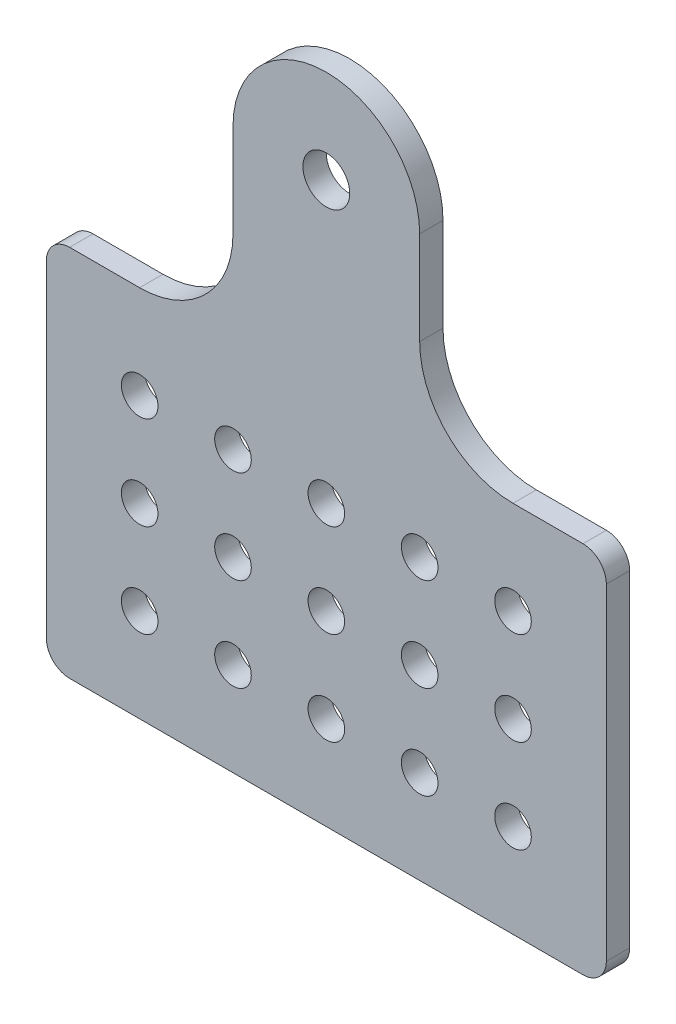
ISO-10303-21;
HEADER;
FILE_DESCRIPTION(('STEP AP214'),'2;1');
FILE_NAME('part.step','',(''),(''),'','','');
FILE_SCHEMA(('AUTOMOTIVE_DESIGN { 1 0 10303 214 1 1 1 1 }'));
ENDSEC;
DATA;
#1=APPLICATION_CONTEXT('core data for automotive mechanical design processes');
#2=APPLICATION_PROTOCOL_DEFINITION('international standard','automotive_design',2000,#1);
#3=PRODUCT_CONTEXT('',#1,'mechanical');
#4=PRODUCT('Part','Part','',(#3));
#5=PRODUCT_RELATED_PRODUCT_CATEGORY('part','',(#4));
#6=PRODUCT_DEFINITION_FORMATION('','',#4);
#7=PRODUCT_DEFINITION_CONTEXT('part definition',#1,'design');
#8=PRODUCT_DEFINITION('design','',#6,#7);
#9=PRODUCT_DEFINITION_SHAPE('','',#8);
#10=(LENGTH_UNIT() NAMED_UNIT(*) SI_UNIT(.MILLI.,.METRE.));
#11=(NAMED_UNIT(*) PLANE_ANGLE_UNIT() SI_UNIT($,.RADIAN.));
#12=(NAMED_UNIT(*) SI_UNIT($,.STERADIAN.) SOLID_ANGLE_UNIT());
#13=UNCERTAINTY_MEASURE_WITH_UNIT(LENGTH_MEASURE(1.E-05),#10,'distance_accuracy_value','');
#14=(GEOMETRIC_REPRESENTATION_CONTEXT(3) GLOBAL_UNCERTAINTY_ASSIGNED_CONTEXT((#13)) GLOBAL_UNIT_ASSIGNED_CONTEXT((#10,
#11,#12)) REPRESENTATION_CONTEXT('',''));
#15=CARTESIAN_POINT('',(0.,0.,0.));
#16=DIRECTION('',(0.,0.,1.));
#17=DIRECTION('',(1.,0.,0.));
#18=AXIS2_PLACEMENT_3D('',#15,#16,#17);
#19=CARTESIAN_POINT('',(0.,38.5884615384616,3.175));
#20=DIRECTION('',(0.,0.,1.));
#21=DIRECTION('',(1.,0.,0.));
#22=AXIS2_PLACEMENT_3D('',#19,#20,#21);
#23=PLANE('',#22);
#24=CARTESIAN_POINT('',(0.,76.2,3.175));
#25=DIRECTION('',(0.,0.,1.));
#26=DIRECTION('',(1.,0.,0.));
#27=AXIS2_PLACEMENT_3D('',#24,#25,#26);
#28=CIRCLE('',#27,3.1877);
#29=CARTESIAN_POINT('',(3.18769999999999,76.2,3.175));
#30=VERTEX_POINT('',#29);
#31=EDGE_CURVE('E231',#30,#30,#28,.F.);
#32=ORIENTED_EDGE('',*,*,#31,.T.);
#33=EDGE_LOOP('',(#32));
#34=FACE_BOUND('',#33,.T.);
#35=CARTESIAN_POINT('',(-25.4,38.1,3.175));
#36=DIRECTION('',(0.,0.,1.));
#37=DIRECTION('',(1.,0.,0.));
#38=AXIS2_PLACEMENT_3D('',#35,#36,#37);
#39=CIRCLE('',#38,2.4892);
#40=CARTESIAN_POINT('',(-22.9108,38.1,3.175));
#41=VERTEX_POINT('',#40);
#42=EDGE_CURVE('E234',#41,#41,#39,.F.);
#43=ORIENTED_EDGE('',*,*,#42,.T.);
#44=EDGE_LOOP('',(#43));
#45=FACE_BOUND('',#44,.T.);
#46=CARTESIAN_POINT('',(-12.7,38.1,3.175));
#47=DIRECTION('',(0.,0.,1.));
#48=DIRECTION('',(1.,0.,0.));
#49=AXIS2_PLACEMENT_3D('',#46,#47,#48);
#50=CIRCLE('',#49,2.4892);
#51=CARTESIAN_POINT('',(-10.2108,38.1,3.175));
#52=VERTEX_POINT('',#51);
#53=EDGE_CURVE('E237',#52,#52,#50,.F.);
#54=ORIENTED_EDGE('',*,*,#53,.T.);
#55=EDGE_LOOP('',(#54));
#56=FACE_BOUND('',#55,.T.);
#57=CARTESIAN_POINT('',(0.,38.1,3.175));
#58=DIRECTION('',(0.,0.,1.));
#59=DIRECTION('',(1.,0.,0.));
#60=AXIS2_PLACEMENT_3D('',#57,#58,#59);
#61=CIRCLE('',#60,2.4892);
#62=CARTESIAN_POINT('',(2.4892,38.1,3.175));
#63=VERTEX_POINT('',#62);
#64=EDGE_CURVE('E240',#63,#63,#61,.F.);
#65=ORIENTED_EDGE('',*,*,#64,.T.);
#66=EDGE_LOOP('',(#65));
#67=FACE_BOUND('',#66,.T.);
#68=CARTESIAN_POINT('',(12.7,38.1,3.175));
#69=DIRECTION('',(0.,0.,1.));
#70=DIRECTION('',(1.,0.,0.));
#71=AXIS2_PLACEMENT_3D('',#68,#69,#70);
#72=CIRCLE('',#71,2.4892);
#73=CARTESIAN_POINT('',(15.1892,38.1,3.175));
#74=VERTEX_POINT('',#73);
#75=EDGE_CURVE('E243',#74,#74,#72,.F.);
#76=ORIENTED_EDGE('',*,*,#75,.T.);
#77=EDGE_LOOP('',(#76));
#78=FACE_BOUND('',#77,.T.);
#79=CARTESIAN_POINT('',(25.4,38.1,3.175));
#80=DIRECTION('',(0.,0.,1.));
#81=DIRECTION('',(1.,0.,0.));
#82=AXIS2_PLACEMENT_3D('',#79,#80,#81);
#83=CIRCLE('',#82,2.4892);
#84=CARTESIAN_POINT('',(27.8892,38.1,3.175));
#85=VERTEX_POINT('',#84);
#86=EDGE_CURVE('E246',#85,#85,#83,.F.);
#87=ORIENTED_EDGE('',*,*,#86,.T.);
#88=EDGE_LOOP('',(#87));
#89=FACE_BOUND('',#88,.T.);
#90=CARTESIAN_POINT('',(-25.4,25.4,3.175));
#91=DIRECTION('',(0.,0.,1.));
#92=DIRECTION('',(1.,0.,0.));
#93=AXIS2_PLACEMENT_3D('',#90,#91,#92);
#94=CIRCLE('',#93,2.4892);
#95=CARTESIAN_POINT('',(-22.9108,25.4,3.175));
#96=VERTEX_POINT('',#95);
#97=EDGE_CURVE('E249',#96,#96,#94,.F.);
#98=ORIENTED_EDGE('',*,*,#97,.T.);
#99=EDGE_LOOP('',(#98));
#100=FACE_BOUND('',#99,.T.);
#101=CARTESIAN_POINT('',(-12.7,25.4,3.175));
#102=DIRECTION('',(0.,0.,1.));
#103=DIRECTION('',(1.,0.,0.));
#104=AXIS2_PLACEMENT_3D('',#101,#102,#103);
#105=CIRCLE('',#104,2.4892);
#106=CARTESIAN_POINT('',(-10.2108,25.4,3.175));
#107=VERTEX_POINT('',#106);
#108=EDGE_CURVE('E252',#107,#107,#105,.F.);
#109=ORIENTED_EDGE('',*,*,#108,.T.);
#110=EDGE_LOOP('',(#109));
#111=FACE_BOUND('',#110,.T.);
#112=CARTESIAN_POINT('',(0.,25.4,3.175));
#113=DIRECTION('',(0.,0.,1.));
#114=DIRECTION('',(1.,0.,0.));
#115=AXIS2_PLACEMENT_3D('',#112,#113,#114);
#116=CIRCLE('',#115,2.4892);
#117=CARTESIAN_POINT('',(2.4892,25.4,3.175));
#118=VERTEX_POINT('',#117);
#119=EDGE_CURVE('E255',#118,#118,#116,.F.);
#120=ORIENTED_EDGE('',*,*,#119,.T.);
#121=EDGE_LOOP('',(#120));
#122=FACE_BOUND('',#121,.T.);
#123=CARTESIAN_POINT('',(12.7,25.4,3.175));
#124=DIRECTION('',(0.,0.,1.));
#125=DIRECTION('',(1.,0.,0.));
#126=AXIS2_PLACEMENT_3D('',#123,#124,#125);
#127=CIRCLE('',#126,2.4892);
#128=CARTESIAN_POINT('',(15.1892,25.4,3.175));
#129=VERTEX_POINT('',#128);
#130=EDGE_CURVE('E258',#129,#129,#127,.F.);
#131=ORIENTED_EDGE('',*,*,#130,.T.);
#132=EDGE_LOOP('',(#131));
#133=FACE_BOUND('',#132,.T.);
#134=CARTESIAN_POINT('',(25.4,25.4,3.175));
#135=DIRECTION('',(0.,0.,1.));
#136=DIRECTION('',(1.,0.,0.));
#137=AXIS2_PLACEMENT_3D('',#134,#135,#136);
#138=CIRCLE('',#137,2.4892);
#139=CARTESIAN_POINT('',(27.8892,25.4,3.175));
#140=VERTEX_POINT('',#139);
#141=EDGE_CURVE('E261',#140,#140,#138,.F.);
#142=ORIENTED_EDGE('',*,*,#141,.T.);
#143=EDGE_LOOP('',(#142));
#144=FACE_BOUND('',#143,.T.);
#145=CARTESIAN_POINT('',(-25.4,12.7,3.175));
#146=DIRECTION('',(0.,0.,1.));
#147=DIRECTION('',(1.,0.,0.));
#148=AXIS2_PLACEMENT_3D('',#145,#146,#147);
#149=CIRCLE('',#148,2.4892);
#150=CARTESIAN_POINT('',(-22.9108,12.7,3.175));
#151=VERTEX_POINT('',#150);
#152=EDGE_CURVE('E264',#151,#151,#149,.F.);
#153=ORIENTED_EDGE('',*,*,#152,.T.);
#154=EDGE_LOOP('',(#153));
#155=FACE_BOUND('',#154,.T.);
#156=CARTESIAN_POINT('',(-12.7,12.7,3.175));
#157=DIRECTION('',(0.,0.,1.));
#158=DIRECTION('',(1.,0.,0.));
#159=AXIS2_PLACEMENT_3D('',#156,#157,#158);
#160=CIRCLE('',#159,2.4892);
#161=CARTESIAN_POINT('',(-10.2108,12.7,3.175));
#162=VERTEX_POINT('',#161);
#163=EDGE_CURVE('E267',#162,#162,#160,.F.);
#164=ORIENTED_EDGE('',*,*,#163,.T.);
#165=EDGE_LOOP('',(#164));
#166=FACE_BOUND('',#165,.T.);
#167=CARTESIAN_POINT('',(0.,12.7,3.175));
#168=DIRECTION('',(0.,0.,1.));
#169=DIRECTION('',(1.,0.,0.));
#170=AXIS2_PLACEMENT_3D('',#167,#168,#169);
#171=CIRCLE('',#170,2.4892);
#172=CARTESIAN_POINT('',(2.4892,12.7,3.175));
#173=VERTEX_POINT('',#172);
#174=EDGE_CURVE('E270',#173,#173,#171,.F.);
#175=ORIENTED_EDGE('',*,*,#174,.T.);
#176=EDGE_LOOP('',(#175));
#177=FACE_BOUND('',#176,.T.);
#178=CARTESIAN_POINT('',(12.7,12.7,3.175));
#179=DIRECTION('',(0.,0.,1.));
#180=DIRECTION('',(1.,0.,0.));
#181=AXIS2_PLACEMENT_3D('',#178,#179,#180);
#182=CIRCLE('',#181,2.4892);
#183=CARTESIAN_POINT('',(15.1892,12.7,3.175));
#184=VERTEX_POINT('',#183);
#185=EDGE_CURVE('E273',#184,#184,#182,.F.);
#186=ORIENTED_EDGE('',*,*,#185,.T.);
#187=EDGE_LOOP('',(#186));
#188=FACE_BOUND('',#187,.T.);
#189=CARTESIAN_POINT('',(25.4,12.7,3.175));
#190=DIRECTION('',(0.,0.,1.));
#191=DIRECTION('',(1.,0.,0.));
#192=AXIS2_PLACEMENT_3D('',#189,#190,#191);
#193=CIRCLE('',#192,2.4892);
#194=CARTESIAN_POINT('',(27.8892,12.7,3.175));
#195=VERTEX_POINT('',#194);
#196=EDGE_CURVE('E276',#195,#195,#193,.F.);
#197=ORIENTED_EDGE('',*,*,#196,.T.);
#198=EDGE_LOOP('',(#197));
#199=FACE_BOUND('',#198,.T.);
#200=CARTESIAN_POINT('',(25.4,63.5,3.175));
#201=DIRECTION('',(0.,0.,1.));
#202=DIRECTION('',(1.,0.,0.));
#203=AXIS2_PLACEMENT_3D('',#200,#201,#202);
#204=CIRCLE('',#203,12.7);
#205=CARTESIAN_POINT('',(25.4,50.8,3.175));
#206=VERTEX_POINT('',#205);
#207=CARTESIAN_POINT('',(12.7,63.5,3.175));
#208=VERTEX_POINT('',#207);
#209=EDGE_CURVE('E281',#206,#208,#204,.F.);
#210=ORIENTED_EDGE('',*,*,#209,.T.);
#211=DIRECTION('',(0.,1.,0.));
#212=VECTOR('',#211,1.);
#213=CARTESIAN_POINT('',(12.7,50.8,3.175));
#214=LINE('',#213,#212);
#215=CARTESIAN_POINT('',(12.7,76.2,3.175));
#216=VERTEX_POINT('',#215);
#217=EDGE_CURVE('E142',#216,#208,#214,.F.);
#218=ORIENTED_EDGE('',*,*,#217,.F.);
#219=CARTESIAN_POINT('',(0.,76.2,3.175));
#220=DIRECTION('',(0.,0.,1.));
#221=DIRECTION('',(1.,0.,0.));
#222=AXIS2_PLACEMENT_3D('',#219,#220,#221);
#223=CIRCLE('',#222,12.7);
#224=CARTESIAN_POINT('',(-12.7,76.2,3.175));
#225=VERTEX_POINT('',#224);
#226=EDGE_CURVE('E145',#225,#216,#223,.F.);
#227=ORIENTED_EDGE('',*,*,#226,.F.);
#228=DIRECTION('',(0.,-1.,0.));
#229=VECTOR('',#228,1.);
#230=CARTESIAN_POINT('',(-12.7,88.9,3.175));
#231=LINE('',#230,#229);
#232=CARTESIAN_POINT('',(-12.7,63.5,3.175));
#233=VERTEX_POINT('',#232);
#234=EDGE_CURVE('E113',#233,#225,#231,.F.);
#235=ORIENTED_EDGE('',*,*,#234,.F.);
#236=CARTESIAN_POINT('',(-25.4,63.5,3.175));
#237=DIRECTION('',(0.,0.,1.));
#238=DIRECTION('',(1.,0.,0.));
#239=AXIS2_PLACEMENT_3D('',#236,#237,#238);
#240=CIRCLE('',#239,12.7);
#241=CARTESIAN_POINT('',(-25.4,50.8,3.175));
#242=VERTEX_POINT('',#241);
#243=EDGE_CURVE('E18',#233,#242,#240,.F.);
#244=ORIENTED_EDGE('',*,*,#243,.T.);
#245=DIRECTION('',(-1.,0.,0.));
#246=VECTOR('',#245,1.);
#247=CARTESIAN_POINT('',(-12.7,50.8,3.175));
#248=LINE('',#247,#246);
#249=CARTESIAN_POINT('',(-34.925,50.8,3.175));
#250=VERTEX_POINT('',#249);
#251=EDGE_CURVE('E118',#250,#242,#248,.F.);
#252=ORIENTED_EDGE('',*,*,#251,.F.);
#253=CARTESIAN_POINT('',(-34.925,47.625,3.175));
#254=DIRECTION('',(0.,0.,1.));
#255=DIRECTION('',(1.,0.,0.));
#256=AXIS2_PLACEMENT_3D('',#253,#254,#255);
#257=CIRCLE('',#256,3.175);
#258=CARTESIAN_POINT('',(-38.1,47.625,3.175));
#259=VERTEX_POINT('',#258);
#260=EDGE_CURVE('E130',#259,#250,#257,.F.);
#261=ORIENTED_EDGE('',*,*,#260,.F.);
#262=DIRECTION('',(0.,1.,0.));
#263=VECTOR('',#262,1.);
#264=CARTESIAN_POINT('',(-38.1,50.8,3.175));
#265=LINE('',#264,#263);
#266=CARTESIAN_POINT('',(-38.1,3.175,3.175));
#267=VERTEX_POINT('',#266);
#268=EDGE_CURVE('E159',#267,#259,#265,.T.);
#269=ORIENTED_EDGE('',*,*,#268,.F.);
#270=CARTESIAN_POINT('',(-34.925,3.175,3.175));
#271=DIRECTION('',(0.,0.,1.));
#272=DIRECTION('',(1.,0.,0.));
#273=AXIS2_PLACEMENT_3D('',#270,#271,#272);
#274=CIRCLE('',#273,3.175);
#275=CARTESIAN_POINT('',(-34.925,0.,3.175));
#276=VERTEX_POINT('',#275);
#277=EDGE_CURVE('E288',#276,#267,#274,.F.);
#278=ORIENTED_EDGE('',*,*,#277,.F.);
#279=DIRECTION('',(1.,0.,0.));
#280=VECTOR('',#279,1.);
#281=CARTESIAN_POINT('',(-38.1,0.,3.175));
#282=LINE('',#281,#280);
#283=CARTESIAN_POINT('',(34.925,0.,3.175));
#284=VERTEX_POINT('',#283);
#285=EDGE_CURVE('E155',#284,#276,#282,.F.);
#286=ORIENTED_EDGE('',*,*,#285,.F.);
#287=CARTESIAN_POINT('',(34.925,3.17500000000003,3.175));
#288=DIRECTION('',(0.,0.,1.));
#289=DIRECTION('',(1.,0.,0.));
#290=AXIS2_PLACEMENT_3D('',#287,#288,#289);
#291=CIRCLE('',#290,3.175);
#292=CARTESIAN_POINT('',(38.1,3.17500000000003,3.175));
#293=VERTEX_POINT('',#292);
#294=EDGE_CURVE('E286',#293,#284,#291,.F.);
#295=ORIENTED_EDGE('',*,*,#294,.F.);
#296=DIRECTION('',(0.,1.,0.));
#297=VECTOR('',#296,1.);
#298=CARTESIAN_POINT('',(38.1,0.,3.175));
#299=LINE('',#298,#297);
#300=CARTESIAN_POINT('',(38.1,47.625,3.175));
#301=VERTEX_POINT('',#300);
#302=EDGE_CURVE('E151',#301,#293,#299,.F.);
#303=ORIENTED_EDGE('',*,*,#302,.F.);
#304=CARTESIAN_POINT('',(34.925,47.625,3.175));
#305=DIRECTION('',(0.,0.,1.));
#306=DIRECTION('',(1.,0.,0.));
#307=AXIS2_PLACEMENT_3D('',#304,#305,#306);
#308=CIRCLE('',#307,3.175);
#309=CARTESIAN_POINT('',(34.925,50.8,3.175));
#310=VERTEX_POINT('',#309);
#311=EDGE_CURVE('E284',#310,#301,#308,.F.);
#312=ORIENTED_EDGE('',*,*,#311,.F.);
#313=DIRECTION('',(-1.,0.,0.));
#314=VECTOR('',#313,1.);
#315=CARTESIAN_POINT('',(38.1,50.8,3.175));
#316=LINE('',#315,#314);
#317=EDGE_CURVE('E147',#206,#310,#316,.F.);
#318=ORIENTED_EDGE('',*,*,#317,.F.);
#319=EDGE_LOOP('',(#210,#218,#227,#235,#244,#252,#261,#269,#278,#286,#295,#303,#312,#318));
#320=FACE_BOUND('',#319,.T.);
#321=ADVANCED_FACE('F15',(#34,#45,#56,#67,#78,#89,#100,#111,#122,#133,#144,#155,#166,#177,#188,
#199,#320),#23,.T.);
#322=CARTESIAN_POINT('',(-12.7,88.9,0.));
#323=DIRECTION('',(-1.,0.,0.));
#324=DIRECTION('',(0.,-1.,0.));
#325=AXIS2_PLACEMENT_3D('',#322,#323,#324);
#326=PLANE('',#325);
#327=DIRECTION('',(0.,0.,1.));
#328=VECTOR('',#327,1.);
#329=CARTESIAN_POINT('',(-12.7,76.2,0.));
#330=LINE('',#329,#328);
#331=CARTESIAN_POINT('',(-12.7,76.2,0.));
#332=VERTEX_POINT('',#331);
#333=EDGE_CURVE('E279',#332,#225,#330,.T.);
#334=ORIENTED_EDGE('',*,*,#333,.F.);
#335=DIRECTION('',(0.,1.,0.));
#336=VECTOR('',#335,1.);
#337=CARTESIAN_POINT('',(-12.7,38.5884615384616,0.));
#338=LINE('',#337,#336);
#339=CARTESIAN_POINT('',(-12.7,63.5,0.));
#340=VERTEX_POINT('',#339);
#341=EDGE_CURVE('E230',#332,#340,#338,.F.);
#342=ORIENTED_EDGE('',*,*,#341,.T.);
#343=DIRECTION('',(0.,0.,1.));
#344=VECTOR('',#343,1.);
#345=CARTESIAN_POINT('',(-12.7,63.5,0.));
#346=LINE('',#345,#344);
#347=EDGE_CURVE('E124',#340,#233,#346,.T.);
#348=ORIENTED_EDGE('',*,*,#347,.T.);
#349=ORIENTED_EDGE('',*,*,#234,.T.);
#350=EDGE_LOOP('',(#334,#342,#348,#349));
#351=FACE_BOUND('',#350,.T.);
#352=ADVANCED_FACE('F365',(#351),#326,.T.);
#353=CARTESIAN_POINT('',(-25.4,63.5,0.));
#354=DIRECTION('',(0.,0.,1.));
#355=DIRECTION('',(1.,0.,0.));
#356=AXIS2_PLACEMENT_3D('',#353,#354,#355);
#357=CYLINDRICAL_SURFACE('',#356,12.7);
#358=DIRECTION('',(0.,0.,1.));
#359=VECTOR('',#358,1.);
#360=CARTESIAN_POINT('',(-25.4,50.8,0.));
#361=LINE('',#360,#359);
#362=CARTESIAN_POINT('',(-25.4,50.8,0.));
#363=VERTEX_POINT('',#362);
#364=EDGE_CURVE('E123',#242,#363,#361,.F.);
#365=ORIENTED_EDGE('',*,*,#364,.F.);
#366=ORIENTED_EDGE('',*,*,#243,.F.);
#367=ORIENTED_EDGE('',*,*,#347,.F.);
#368=CARTESIAN_POINT('',(-25.4,63.5,0.));
#369=DIRECTION('',(0.,0.,1.));
#370=DIRECTION('',(1.,0.,0.));
#371=AXIS2_PLACEMENT_3D('',#368,#369,#370);
#372=CIRCLE('',#371,12.7);
#373=EDGE_CURVE('E135',#340,#363,#372,.F.);
#374=ORIENTED_EDGE('',*,*,#373,.T.);
#375=EDGE_LOOP('',(#365,#366,#367,#374));
#376=FACE_BOUND('',#375,.T.);
#377=ADVANCED_FACE('F133',(#376),#357,.F.);
#378=CARTESIAN_POINT('',(-12.7,50.8,0.));
#379=DIRECTION('',(0.,1.,0.));
#380=DIRECTION('',(-1.,0.,0.));
#381=AXIS2_PLACEMENT_3D('',#378,#379,#380);
#382=PLANE('',#381);
#383=DIRECTION('',(0.,0.,1.));
#384=VECTOR('',#383,1.);
#385=CARTESIAN_POINT('',(-34.925,50.8,0.));
#386=LINE('',#385,#384);
#387=CARTESIAN_POINT('',(-34.925,50.8,0.));
#388=VERTEX_POINT('',#387);
#389=EDGE_CURVE('E129',#250,#388,#386,.F.);
#390=ORIENTED_EDGE('',*,*,#389,.F.);
#391=ORIENTED_EDGE('',*,*,#251,.T.);
#392=ORIENTED_EDGE('',*,*,#364,.T.);
#393=DIRECTION('',(1.,0.,0.));
#394=VECTOR('',#393,1.);
#395=CARTESIAN_POINT('',(0.,50.8,0.));
#396=LINE('',#395,#394);
#397=EDGE_CURVE('E228',#363,#388,#396,.F.);
#398=ORIENTED_EDGE('',*,*,#397,.T.);
#399=EDGE_LOOP('',(#390,#391,#392,#398));
#400=FACE_BOUND('',#399,.T.);
#401=ADVANCED_FACE('F126',(#400),#382,.T.);
#402=CARTESIAN_POINT('',(-34.925,47.625,0.));
#403=DIRECTION('',(0.,0.,1.));
#404=DIRECTION('',(1.,0.,0.));
#405=AXIS2_PLACEMENT_3D('',#402,#403,#404);
#406=CYLINDRICAL_SURFACE('',#405,3.175);
#407=CARTESIAN_POINT('',(-34.925,47.625,0.));
#408=DIRECTION('',(0.,0.,1.));
#409=DIRECTION('',(1.,0.,0.));
#410=AXIS2_PLACEMENT_3D('',#407,#408,#409);
#411=CIRCLE('',#410,3.175);
#412=CARTESIAN_POINT('',(-38.1,47.625,0.));
#413=VERTEX_POINT('',#412);
#414=EDGE_CURVE('E225',#388,#413,#411,.T.);
#415=ORIENTED_EDGE('',*,*,#414,.T.);
#416=DIRECTION('',(0.,0.,1.));
#417=VECTOR('',#416,1.);
#418=CARTESIAN_POINT('',(-38.1,47.625,0.));
#419=LINE('',#418,#417);
#420=EDGE_CURVE('E160',#259,#413,#419,.F.);
#421=ORIENTED_EDGE('',*,*,#420,.F.);
#422=ORIENTED_EDGE('',*,*,#260,.T.);
#423=ORIENTED_EDGE('',*,*,#389,.T.);
#424=EDGE_LOOP('',(#415,#421,#422,#423));
#425=FACE_BOUND('',#424,.T.);
#426=ADVANCED_FACE('F292',(#425),#406,.T.);
#427=CARTESIAN_POINT('',(-38.1,50.8,0.));
#428=DIRECTION('',(-1.,0.,0.));
#429=DIRECTION('',(0.,0.,1.));
#430=AXIS2_PLACEMENT_3D('',#427,#428,#429);
#431=PLANE('',#430);
#432=ORIENTED_EDGE('',*,*,#420,.T.);
#433=DIRECTION('',(0.,1.,0.));
#434=VECTOR('',#433,1.);
#435=CARTESIAN_POINT('',(-38.1,38.5884615384616,0.));
#436=LINE('',#435,#434);
#437=CARTESIAN_POINT('',(-38.1,3.175,0.));
#438=VERTEX_POINT('',#437);
#439=EDGE_CURVE('E224',#413,#438,#436,.F.);
#440=ORIENTED_EDGE('',*,*,#439,.T.);
#441=DIRECTION('',(0.,0.,1.));
#442=VECTOR('',#441,1.);
#443=CARTESIAN_POINT('',(-38.1,3.175,0.));
#444=LINE('',#443,#442);
#445=EDGE_CURVE('E158',#267,#438,#444,.F.);
#446=ORIENTED_EDGE('',*,*,#445,.F.);
#447=ORIENTED_EDGE('',*,*,#268,.T.);
#448=EDGE_LOOP('',(#432,#440,#446,#447));
#449=FACE_BOUND('',#448,.T.);
#450=ADVANCED_FACE('F317',(#449),#431,.T.);
#451=CARTESIAN_POINT('',(-34.925,3.175,0.));
#452=DIRECTION('',(0.,0.,1.));
#453=DIRECTION('',(1.,0.,0.));
#454=AXIS2_PLACEMENT_3D('',#451,#452,#453);
#455=CYLINDRICAL_SURFACE('',#454,3.175);
#456=CARTESIAN_POINT('',(-34.925,3.175,0.));
#457=DIRECTION('',(0.,0.,1.));
#458=DIRECTION('',(1.,0.,0.));
#459=AXIS2_PLACEMENT_3D('',#456,#457,#458);
#460=CIRCLE('',#459,3.175);
#461=CARTESIAN_POINT('',(-34.925,0.,0.));
#462=VERTEX_POINT('',#461);
#463=EDGE_CURVE('E221',#438,#462,#460,.T.);
#464=ORIENTED_EDGE('',*,*,#463,.T.);
#465=DIRECTION('',(0.,0.,1.));
#466=VECTOR('',#465,1.);
#467=CARTESIAN_POINT('',(-34.925,0.,0.));
#468=LINE('',#467,#466);
#469=EDGE_CURVE('E157',#276,#462,#468,.F.);
#470=ORIENTED_EDGE('',*,*,#469,.F.);
#471=ORIENTED_EDGE('',*,*,#277,.T.);
#472=ORIENTED_EDGE('',*,*,#445,.T.);
#473=EDGE_LOOP('',(#464,#470,#471,#472));
#474=FACE_BOUND('',#473,.T.);
#475=ADVANCED_FACE('F326',(#474),#455,.T.);
#476=CARTESIAN_POINT('',(-38.1,0.,0.));
#477=DIRECTION('',(0.,-1.,0.));
#478=DIRECTION('',(1.,0.,0.));
#479=AXIS2_PLACEMENT_3D('',#476,#477,#478);
#480=PLANE('',#479);
#481=ORIENTED_EDGE('',*,*,#469,.T.);
#482=DIRECTION('',(1.,0.,0.));
#483=VECTOR('',#482,1.);
#484=CARTESIAN_POINT('',(0.,0.,0.));
#485=LINE('',#484,#483);
#486=CARTESIAN_POINT('',(34.925,0.,0.));
#487=VERTEX_POINT('',#486);
#488=EDGE_CURVE('E220',#462,#487,#485,.T.);
#489=ORIENTED_EDGE('',*,*,#488,.T.);
#490=DIRECTION('',(0.,0.,1.));
#491=VECTOR('',#490,1.);
#492=CARTESIAN_POINT('',(34.925,0.,0.));
#493=LINE('',#492,#491);
#494=EDGE_CURVE('E154',#284,#487,#493,.F.);
#495=ORIENTED_EDGE('',*,*,#494,.F.);
#496=ORIENTED_EDGE('',*,*,#285,.T.);
#497=EDGE_LOOP('',(#481,#489,#495,#496));
#498=FACE_BOUND('',#497,.T.);
#499=ADVANCED_FACE('F330',(#498),#480,.T.);
#500=CARTESIAN_POINT('',(34.925,3.17500000000003,0.));
#501=DIRECTION('',(0.,0.,1.));
#502=DIRECTION('',(1.,0.,0.));
#503=AXIS2_PLACEMENT_3D('',#500,#501,#502);
#504=CYLINDRICAL_SURFACE('',#503,3.175);
#505=CARTESIAN_POINT('',(34.925,3.17500000000003,0.));
#506=DIRECTION('',(0.,0.,1.));
#507=DIRECTION('',(1.,0.,0.));
#508=AXIS2_PLACEMENT_3D('',#505,#506,#507);
#509=CIRCLE('',#508,3.175);
#510=CARTESIAN_POINT('',(38.1,3.17500000000003,0.));
#511=VERTEX_POINT('',#510);
#512=EDGE_CURVE('E217',#487,#511,#509,.T.);
#513=ORIENTED_EDGE('',*,*,#512,.T.);
#514=DIRECTION('',(0.,0.,1.));
#515=VECTOR('',#514,1.);
#516=CARTESIAN_POINT('',(38.1,3.17500000000003,0.));
#517=LINE('',#516,#515);
#518=EDGE_CURVE('E153',#293,#511,#517,.F.);
#519=ORIENTED_EDGE('',*,*,#518,.F.);
#520=ORIENTED_EDGE('',*,*,#294,.T.);
#521=ORIENTED_EDGE('',*,*,#494,.T.);
#522=EDGE_LOOP('',(#513,#519,#520,#521));
#523=FACE_BOUND('',#522,.T.);
#524=ADVANCED_FACE('F360',(#523),#504,.T.);
#525=CARTESIAN_POINT('',(38.1,0.,0.));
#526=DIRECTION('',(1.,0.,0.));
#527=DIRECTION('',(0.,1.,0.));
#528=AXIS2_PLACEMENT_3D('',#525,#526,#527);
#529=PLANE('',#528);
#530=ORIENTED_EDGE('',*,*,#518,.T.);
#531=DIRECTION('',(0.,1.,0.));
#532=VECTOR('',#531,1.);
#533=CARTESIAN_POINT('',(38.1,38.5884615384616,0.));
#534=LINE('',#533,#532);
#535=CARTESIAN_POINT('',(38.1,47.625,0.));
#536=VERTEX_POINT('',#535);
#537=EDGE_CURVE('E216',#511,#536,#534,.T.);
#538=ORIENTED_EDGE('',*,*,#537,.T.);
#539=DIRECTION('',(0.,0.,1.));
#540=VECTOR('',#539,1.);
#541=CARTESIAN_POINT('',(38.1,47.625,0.));
#542=LINE('',#541,#540);
#543=EDGE_CURVE('E150',#301,#536,#542,.F.);
#544=ORIENTED_EDGE('',*,*,#543,.F.);
#545=ORIENTED_EDGE('',*,*,#302,.T.);
#546=EDGE_LOOP('',(#530,#538,#544,#545));
#547=FACE_BOUND('',#546,.T.);
#548=ADVANCED_FACE('F357',(#547),#529,.T.);
#549=CARTESIAN_POINT('',(34.925,47.625,0.));
#550=DIRECTION('',(0.,0.,1.));
#551=DIRECTION('',(1.,0.,0.));
#552=AXIS2_PLACEMENT_3D('',#549,#550,#551);
#553=CYLINDRICAL_SURFACE('',#552,3.175);
#554=CARTESIAN_POINT('',(34.925,47.625,0.));
#555=DIRECTION('',(0.,0.,1.));
#556=DIRECTION('',(1.,0.,0.));
#557=AXIS2_PLACEMENT_3D('',#554,#555,#556);
#558=CIRCLE('',#557,3.175);
#559=CARTESIAN_POINT('',(34.925,50.8,0.));
#560=VERTEX_POINT('',#559);
#561=EDGE_CURVE('E213',#536,#560,#558,.T.);
#562=ORIENTED_EDGE('',*,*,#561,.T.);
#563=DIRECTION('',(0.,0.,1.));
#564=VECTOR('',#563,1.);
#565=CARTESIAN_POINT('',(34.925,50.8,0.));
#566=LINE('',#565,#564);
#567=EDGE_CURVE('E149',#310,#560,#566,.F.);
#568=ORIENTED_EDGE('',*,*,#567,.F.);
#569=ORIENTED_EDGE('',*,*,#311,.T.);
#570=ORIENTED_EDGE('',*,*,#543,.T.);
#571=EDGE_LOOP('',(#562,#568,#569,#570));
#572=FACE_BOUND('',#571,.T.);
#573=ADVANCED_FACE('F353',(#572),#553,.T.);
#574=CARTESIAN_POINT('',(38.1,50.8,0.));
#575=DIRECTION('',(0.,1.,0.));
#576=DIRECTION('',(-1.,0.,0.));
#577=AXIS2_PLACEMENT_3D('',#574,#575,#576);
#578=PLANE('',#577);
#579=ORIENTED_EDGE('',*,*,#567,.T.);
#580=DIRECTION('',(1.,0.,0.));
#581=VECTOR('',#580,1.);
#582=CARTESIAN_POINT('',(0.,50.8,0.));
#583=LINE('',#582,#581);
#584=CARTESIAN_POINT('',(25.4,50.8,0.));
#585=VERTEX_POINT('',#584);
#586=EDGE_CURVE('E212',#560,#585,#583,.F.);
#587=ORIENTED_EDGE('',*,*,#586,.T.);
#588=DIRECTION('',(0.,0.,1.));
#589=VECTOR('',#588,1.);
#590=CARTESIAN_POINT('',(25.4,50.8,0.));
#591=LINE('',#590,#589);
#592=EDGE_CURVE('E283',#585,#206,#591,.T.);
#593=ORIENTED_EDGE('',*,*,#592,.T.);
#594=ORIENTED_EDGE('',*,*,#317,.T.);
#595=EDGE_LOOP('',(#579,#587,#593,#594));
#596=FACE_BOUND('',#595,.T.);
#597=ADVANCED_FACE('F348',(#596),#578,.T.);
#598=CARTESIAN_POINT('',(25.4,63.5,0.));
#599=DIRECTION('',(0.,0.,1.));
#600=DIRECTION('',(1.,0.,0.));
#601=AXIS2_PLACEMENT_3D('',#598,#599,#600);
#602=CYLINDRICAL_SURFACE('',#601,12.7);
#603=DIRECTION('',(0.,0.,-1.));
#604=VECTOR('',#603,1.);
#605=CARTESIAN_POINT('',(12.7,63.5,0.));
#606=LINE('',#605,#604);
#607=CARTESIAN_POINT('',(12.7,63.5,0.));
#608=VERTEX_POINT('',#607);
#609=EDGE_CURVE('E146',#208,#608,#606,.T.);
#610=ORIENTED_EDGE('',*,*,#609,.F.);
#611=ORIENTED_EDGE('',*,*,#209,.F.);
#612=ORIENTED_EDGE('',*,*,#592,.F.);
#613=CARTESIAN_POINT('',(25.4,63.5,0.));
#614=DIRECTION('',(0.,0.,1.));
#615=DIRECTION('',(1.,0.,0.));
#616=AXIS2_PLACEMENT_3D('',#613,#614,#615);
#617=CIRCLE('',#616,12.7);
#618=EDGE_CURVE('E209',#585,#608,#617,.F.);
#619=ORIENTED_EDGE('',*,*,#618,.T.);
#620=EDGE_LOOP('',(#610,#611,#612,#619));
#621=FACE_BOUND('',#620,.T.);
#622=ADVANCED_FACE('F345',(#621),#602,.F.);
#623=CARTESIAN_POINT('',(12.7,50.8,0.));
#624=DIRECTION('',(1.,0.,0.));
#625=DIRECTION('',(0.,0.,-1.));
#626=AXIS2_PLACEMENT_3D('',#623,#624,#625);
#627=PLANE('',#626);
#628=DIRECTION('',(0.,0.,1.));
#629=VECTOR('',#628,1.);
#630=CARTESIAN_POINT('',(12.7,76.2,0.));
#631=LINE('',#630,#629);
#632=CARTESIAN_POINT('',(12.7,76.2,0.));
#633=VERTEX_POINT('',#632);
#634=EDGE_CURVE('E33',#216,#633,#631,.F.);
#635=ORIENTED_EDGE('',*,*,#634,.F.);
#636=ORIENTED_EDGE('',*,*,#217,.T.);
#637=ORIENTED_EDGE('',*,*,#609,.T.);
#638=DIRECTION('',(0.,1.,0.));
#639=VECTOR('',#638,1.);
#640=CARTESIAN_POINT('',(12.7,38.5884615384616,0.));
#641=LINE('',#640,#639);
#642=EDGE_CURVE('E208',#608,#633,#641,.T.);
#643=ORIENTED_EDGE('',*,*,#642,.T.);
#644=EDGE_LOOP('',(#635,#636,#637,#643));
#645=FACE_BOUND('',#644,.T.);
#646=ADVANCED_FACE('F340',(#645),#627,.T.);
#647=CARTESIAN_POINT('',(0.,76.2,0.));
#648=DIRECTION('',(0.,0.,1.));
#649=DIRECTION('',(1.,0.,0.));
#650=AXIS2_PLACEMENT_3D('',#647,#648,#649);
#651=CYLINDRICAL_SURFACE('',#650,12.7);
#652=CARTESIAN_POINT('',(0.,76.2,0.));
#653=DIRECTION('',(0.,0.,1.));
#654=DIRECTION('',(1.,0.,0.));
#655=AXIS2_PLACEMENT_3D('',#652,#653,#654);
#656=CIRCLE('',#655,12.7);
#657=EDGE_CURVE('E206',#633,#332,#656,.T.);
#658=ORIENTED_EDGE('',*,*,#657,.T.);
#659=ORIENTED_EDGE('',*,*,#333,.T.);
#660=ORIENTED_EDGE('',*,*,#226,.T.);
#661=ORIENTED_EDGE('',*,*,#634,.T.);
#662=EDGE_LOOP('',(#658,#659,#660,#661));
#663=FACE_BOUND('',#662,.T.);
#664=ADVANCED_FACE('F362',(#663),#651,.T.);
#665=CARTESIAN_POINT('',(25.4,12.7,-113.956253835174));
#666=DIRECTION('',(0.,0.,1.));
#667=DIRECTION('',(1.,0.,0.));
#668=AXIS2_PLACEMENT_3D('',#665,#666,#667);
#669=CYLINDRICAL_SURFACE('',#668,2.4892);
#670=ORIENTED_EDGE('',*,*,#196,.F.);
#671=EDGE_LOOP('',(#670));
#672=FACE_BOUND('',#671,.T.);
#673=CARTESIAN_POINT('',(25.4,12.7,0.));
#674=DIRECTION('',(0.,0.,1.));
#675=DIRECTION('',(1.,0.,0.));
#676=AXIS2_PLACEMENT_3D('',#673,#674,#675);
#677=CIRCLE('',#676,2.4892);
#678=CARTESIAN_POINT('',(27.8892,12.7,0.));
#679=VERTEX_POINT('',#678);
#680=EDGE_CURVE('E203',#679,#679,#677,.F.);
#681=ORIENTED_EDGE('',*,*,#680,.T.);
#682=EDGE_LOOP('',(#681));
#683=FACE_BOUND('',#682,.T.);
#684=ADVANCED_FACE('F441',(#672,#683),#669,.F.);
#685=CARTESIAN_POINT('',(12.7,12.7,-113.956253835174));
#686=DIRECTION('',(0.,0.,1.));
#687=DIRECTION('',(1.,0.,0.));
#688=AXIS2_PLACEMENT_3D('',#685,#686,#687);
#689=CYLINDRICAL_SURFACE('',#688,2.4892);
#690=ORIENTED_EDGE('',*,*,#185,.F.);
#691=EDGE_LOOP('',(#690));
#692=FACE_BOUND('',#691,.T.);
#693=CARTESIAN_POINT('',(12.7,12.7,0.));
#694=DIRECTION('',(0.,0.,1.));
#695=DIRECTION('',(1.,0.,0.));
#696=AXIS2_PLACEMENT_3D('',#693,#694,#695);
#697=CIRCLE('',#696,2.4892);
#698=CARTESIAN_POINT('',(15.1892,12.7,0.));
#699=VERTEX_POINT('',#698);
#700=EDGE_CURVE('E200',#699,#699,#697,.F.);
#701=ORIENTED_EDGE('',*,*,#700,.T.);
#702=EDGE_LOOP('',(#701));
#703=FACE_BOUND('',#702,.T.);
#704=ADVANCED_FACE('F437',(#692,#703),#689,.F.);
#705=CARTESIAN_POINT('',(0.,12.7,-113.956253835174));
#706=DIRECTION('',(0.,0.,1.));
#707=DIRECTION('',(1.,0.,0.));
#708=AXIS2_PLACEMENT_3D('',#705,#706,#707);
#709=CYLINDRICAL_SURFACE('',#708,2.4892);
#710=ORIENTED_EDGE('',*,*,#174,.F.);
#711=EDGE_LOOP('',(#710));
#712=FACE_BOUND('',#711,.T.);
#713=CARTESIAN_POINT('',(0.,12.7,0.));
#714=DIRECTION('',(0.,0.,1.));
#715=DIRECTION('',(1.,0.,0.));
#716=AXIS2_PLACEMENT_3D('',#713,#714,#715);
#717=CIRCLE('',#716,2.4892);
#718=CARTESIAN_POINT('',(2.4892,12.7,0.));
#719=VERTEX_POINT('',#718);
#720=EDGE_CURVE('E197',#719,#719,#717,.F.);
#721=ORIENTED_EDGE('',*,*,#720,.T.);
#722=EDGE_LOOP('',(#721));
#723=FACE_BOUND('',#722,.T.);
#724=ADVANCED_FACE('F433',(#712,#723),#709,.F.);
#725=CARTESIAN_POINT('',(-12.7,12.7,-113.956253835174));
#726=DIRECTION('',(0.,0.,1.));
#727=DIRECTION('',(1.,0.,0.));
#728=AXIS2_PLACEMENT_3D('',#725,#726,#727);
#729=CYLINDRICAL_SURFACE('',#728,2.4892);
#730=ORIENTED_EDGE('',*,*,#163,.F.);
#731=EDGE_LOOP('',(#730));
#732=FACE_BOUND('',#731,.T.);
#733=CARTESIAN_POINT('',(-12.7,12.7,0.));
#734=DIRECTION('',(0.,0.,1.));
#735=DIRECTION('',(1.,0.,0.));
#736=AXIS2_PLACEMENT_3D('',#733,#734,#735);
#737=CIRCLE('',#736,2.4892);
#738=CARTESIAN_POINT('',(-10.2108,12.7,0.));
#739=VERTEX_POINT('',#738);
#740=EDGE_CURVE('E194',#739,#739,#737,.F.);
#741=ORIENTED_EDGE('',*,*,#740,.T.);
#742=EDGE_LOOP('',(#741));
#743=FACE_BOUND('',#742,.T.);
#744=ADVANCED_FACE('F429',(#732,#743),#729,.F.);
#745=CARTESIAN_POINT('',(-25.4,12.7,-113.956253835174));
#746=DIRECTION('',(0.,0.,1.));
#747=DIRECTION('',(1.,0.,0.));
#748=AXIS2_PLACEMENT_3D('',#745,#746,#747);
#749=CYLINDRICAL_SURFACE('',#748,2.4892);
#750=ORIENTED_EDGE('',*,*,#152,.F.);
#751=EDGE_LOOP('',(#750));
#752=FACE_BOUND('',#751,.T.);
#753=CARTESIAN_POINT('',(-25.4,12.7,0.));
#754=DIRECTION('',(0.,0.,1.));
#755=DIRECTION('',(1.,0.,0.));
#756=AXIS2_PLACEMENT_3D('',#753,#754,#755);
#757=CIRCLE('',#756,2.4892);
#758=CARTESIAN_POINT('',(-22.9108,12.7,0.));
#759=VERTEX_POINT('',#758);
#760=EDGE_CURVE('E191',#759,#759,#757,.F.);
#761=ORIENTED_EDGE('',*,*,#760,.T.);
#762=EDGE_LOOP('',(#761));
#763=FACE_BOUND('',#762,.T.);
#764=ADVANCED_FACE('F425',(#752,#763),#749,.F.);
#765=CARTESIAN_POINT('',(25.4,25.4,-113.956253835174));
#766=DIRECTION('',(0.,0.,1.));
#767=DIRECTION('',(1.,0.,0.));
#768=AXIS2_PLACEMENT_3D('',#765,#766,#767);
#769=CYLINDRICAL_SURFACE('',#768,2.4892);
#770=ORIENTED_EDGE('',*,*,#141,.F.);
#771=EDGE_LOOP('',(#770));
#772=FACE_BOUND('',#771,.T.);
#773=CARTESIAN_POINT('',(25.4,25.4,0.));
#774=DIRECTION('',(0.,0.,1.));
#775=DIRECTION('',(1.,0.,0.));
#776=AXIS2_PLACEMENT_3D('',#773,#774,#775);
#777=CIRCLE('',#776,2.4892);
#778=CARTESIAN_POINT('',(27.8892,25.4,0.));
#779=VERTEX_POINT('',#778);
#780=EDGE_CURVE('E188',#779,#779,#777,.F.);
#781=ORIENTED_EDGE('',*,*,#780,.T.);
#782=EDGE_LOOP('',(#781));
#783=FACE_BOUND('',#782,.T.);
#784=ADVANCED_FACE('F421',(#772,#783),#769,.F.);
#785=CARTESIAN_POINT('',(12.7,25.4,-113.956253835174));
#786=DIRECTION('',(0.,0.,1.));
#787=DIRECTION('',(1.,0.,0.));
#788=AXIS2_PLACEMENT_3D('',#785,#786,#787);
#789=CYLINDRICAL_SURFACE('',#788,2.4892);
#790=ORIENTED_EDGE('',*,*,#130,.F.);
#791=EDGE_LOOP('',(#790));
#792=FACE_BOUND('',#791,.T.);
#793=CARTESIAN_POINT('',(12.7,25.4,0.));
#794=DIRECTION('',(0.,0.,1.));
#795=DIRECTION('',(1.,0.,0.));
#796=AXIS2_PLACEMENT_3D('',#793,#794,#795);
#797=CIRCLE('',#796,2.4892);
#798=CARTESIAN_POINT('',(15.1892,25.4,0.));
#799=VERTEX_POINT('',#798);
#800=EDGE_CURVE('E185',#799,#799,#797,.F.);
#801=ORIENTED_EDGE('',*,*,#800,.T.);
#802=EDGE_LOOP('',(#801));
#803=FACE_BOUND('',#802,.T.);
#804=ADVANCED_FACE('F417',(#792,#803),#789,.F.);
#805=CARTESIAN_POINT('',(0.,25.4,-113.956253835174));
#806=DIRECTION('',(0.,0.,1.));
#807=DIRECTION('',(1.,0.,0.));
#808=AXIS2_PLACEMENT_3D('',#805,#806,#807);
#809=CYLINDRICAL_SURFACE('',#808,2.4892);
#810=ORIENTED_EDGE('',*,*,#119,.F.);
#811=EDGE_LOOP('',(#810));
#812=FACE_BOUND('',#811,.T.);
#813=CARTESIAN_POINT('',(0.,25.4,0.));
#814=DIRECTION('',(0.,0.,1.));
#815=DIRECTION('',(1.,0.,0.));
#816=AXIS2_PLACEMENT_3D('',#813,#814,#815);
#817=CIRCLE('',#816,2.4892);
#818=CARTESIAN_POINT('',(2.4892,25.4,0.));
#819=VERTEX_POINT('',#818);
#820=EDGE_CURVE('E182',#819,#819,#817,.F.);
#821=ORIENTED_EDGE('',*,*,#820,.T.);
#822=EDGE_LOOP('',(#821));
#823=FACE_BOUND('',#822,.T.);
#824=ADVANCED_FACE('F413',(#812,#823),#809,.F.);
#825=CARTESIAN_POINT('',(-12.7,25.4,-113.956253835174));
#826=DIRECTION('',(0.,0.,1.));
#827=DIRECTION('',(1.,0.,0.));
#828=AXIS2_PLACEMENT_3D('',#825,#826,#827);
#829=CYLINDRICAL_SURFACE('',#828,2.4892);
#830=ORIENTED_EDGE('',*,*,#108,.F.);
#831=EDGE_LOOP('',(#830));
#832=FACE_BOUND('',#831,.T.);
#833=CARTESIAN_POINT('',(-12.7,25.4,0.));
#834=DIRECTION('',(0.,0.,1.));
#835=DIRECTION('',(1.,0.,0.));
#836=AXIS2_PLACEMENT_3D('',#833,#834,#835);
#837=CIRCLE('',#836,2.4892);
#838=CARTESIAN_POINT('',(-10.2108,25.4,0.));
#839=VERTEX_POINT('',#838);
#840=EDGE_CURVE('E179',#839,#839,#837,.F.);
#841=ORIENTED_EDGE('',*,*,#840,.T.);
#842=EDGE_LOOP('',(#841));
#843=FACE_BOUND('',#842,.T.);
#844=ADVANCED_FACE('F409',(#832,#843),#829,.F.);
#845=CARTESIAN_POINT('',(-25.4,25.4,-113.956253835174));
#846=DIRECTION('',(0.,0.,1.));
#847=DIRECTION('',(1.,0.,0.));
#848=AXIS2_PLACEMENT_3D('',#845,#846,#847);
#849=CYLINDRICAL_SURFACE('',#848,2.4892);
#850=ORIENTED_EDGE('',*,*,#97,.F.);
#851=EDGE_LOOP('',(#850));
#852=FACE_BOUND('',#851,.T.);
#853=CARTESIAN_POINT('',(-25.4,25.4,0.));
#854=DIRECTION('',(0.,0.,1.));
#855=DIRECTION('',(1.,0.,0.));
#856=AXIS2_PLACEMENT_3D('',#853,#854,#855);
#857=CIRCLE('',#856,2.4892);
#858=CARTESIAN_POINT('',(-22.9108,25.4,0.));
#859=VERTEX_POINT('',#858);
#860=EDGE_CURVE('E176',#859,#859,#857,.F.);
#861=ORIENTED_EDGE('',*,*,#860,.T.);
#862=EDGE_LOOP('',(#861));
#863=FACE_BOUND('',#862,.T.);
#864=ADVANCED_FACE('F405',(#852,#863),#849,.F.);
#865=CARTESIAN_POINT('',(25.4,38.1,-113.956253835174));
#866=DIRECTION('',(0.,0.,1.));
#867=DIRECTION('',(1.,0.,0.));
#868=AXIS2_PLACEMENT_3D('',#865,#866,#867);
#869=CYLINDRICAL_SURFACE('',#868,2.4892);
#870=ORIENTED_EDGE('',*,*,#86,.F.);
#871=EDGE_LOOP('',(#870));
#872=FACE_BOUND('',#871,.T.);
#873=CARTESIAN_POINT('',(25.4,38.1,0.));
#874=DIRECTION('',(0.,0.,1.));
#875=DIRECTION('',(1.,0.,0.));
#876=AXIS2_PLACEMENT_3D('',#873,#874,#875);
#877=CIRCLE('',#876,2.4892);
#878=CARTESIAN_POINT('',(27.8892,38.1,0.));
#879=VERTEX_POINT('',#878);
#880=EDGE_CURVE('E173',#879,#879,#877,.F.);
#881=ORIENTED_EDGE('',*,*,#880,.T.);
#882=EDGE_LOOP('',(#881));
#883=FACE_BOUND('',#882,.T.);
#884=ADVANCED_FACE('F401',(#872,#883),#869,.F.);
#885=CARTESIAN_POINT('',(12.7,38.1,-113.956253835174));
#886=DIRECTION('',(0.,0.,1.));
#887=DIRECTION('',(1.,0.,0.));
#888=AXIS2_PLACEMENT_3D('',#885,#886,#887);
#889=CYLINDRICAL_SURFACE('',#888,2.4892);
#890=ORIENTED_EDGE('',*,*,#75,.F.);
#891=EDGE_LOOP('',(#890));
#892=FACE_BOUND('',#891,.T.);
#893=CARTESIAN_POINT('',(12.7,38.1,0.));
#894=DIRECTION('',(0.,0.,1.));
#895=DIRECTION('',(1.,0.,0.));
#896=AXIS2_PLACEMENT_3D('',#893,#894,#895);
#897=CIRCLE('',#896,2.4892);
#898=CARTESIAN_POINT('',(15.1892,38.1,0.));
#899=VERTEX_POINT('',#898);
#900=EDGE_CURVE('E170',#899,#899,#897,.F.);
#901=ORIENTED_EDGE('',*,*,#900,.T.);
#902=EDGE_LOOP('',(#901));
#903=FACE_BOUND('',#902,.T.);
#904=ADVANCED_FACE('F397',(#892,#903),#889,.F.);
#905=CARTESIAN_POINT('',(0.,38.1,-113.956253835174));
#906=DIRECTION('',(0.,0.,1.));
#907=DIRECTION('',(1.,0.,0.));
#908=AXIS2_PLACEMENT_3D('',#905,#906,#907);
#909=CYLINDRICAL_SURFACE('',#908,2.4892);
#910=ORIENTED_EDGE('',*,*,#64,.F.);
#911=EDGE_LOOP('',(#910));
#912=FACE_BOUND('',#911,.T.);
#913=CARTESIAN_POINT('',(0.,38.1,0.));
#914=DIRECTION('',(0.,0.,1.));
#915=DIRECTION('',(1.,0.,0.));
#916=AXIS2_PLACEMENT_3D('',#913,#914,#915);
#917=CIRCLE('',#916,2.4892);
#918=CARTESIAN_POINT('',(2.4892,38.1,0.));
#919=VERTEX_POINT('',#918);
#920=EDGE_CURVE('E167',#919,#919,#917,.F.);
#921=ORIENTED_EDGE('',*,*,#920,.T.);
#922=EDGE_LOOP('',(#921));
#923=FACE_BOUND('',#922,.T.);
#924=ADVANCED_FACE('F393',(#912,#923),#909,.F.);
#925=CARTESIAN_POINT('',(-12.7,38.1,-113.956253835174));
#926=DIRECTION('',(0.,0.,1.));
#927=DIRECTION('',(1.,0.,0.));
#928=AXIS2_PLACEMENT_3D('',#925,#926,#927);
#929=CYLINDRICAL_SURFACE('',#928,2.4892);
#930=ORIENTED_EDGE('',*,*,#53,.F.);
#931=EDGE_LOOP('',(#930));
#932=FACE_BOUND('',#931,.T.);
#933=CARTESIAN_POINT('',(-12.7,38.1,0.));
#934=DIRECTION('',(0.,0.,1.));
#935=DIRECTION('',(1.,0.,0.));
#936=AXIS2_PLACEMENT_3D('',#933,#934,#935);
#937=CIRCLE('',#936,2.4892);
#938=CARTESIAN_POINT('',(-10.2108,38.1,0.));
#939=VERTEX_POINT('',#938);
#940=EDGE_CURVE('E164',#939,#939,#937,.F.);
#941=ORIENTED_EDGE('',*,*,#940,.T.);
#942=EDGE_LOOP('',(#941));
#943=FACE_BOUND('',#942,.T.);
#944=ADVANCED_FACE('F389',(#932,#943),#929,.F.);
#945=CARTESIAN_POINT('',(-25.4,38.1,-113.956253835174));
#946=DIRECTION('',(0.,0.,1.));
#947=DIRECTION('',(1.,0.,0.));
#948=AXIS2_PLACEMENT_3D('',#945,#946,#947);
#949=CYLINDRICAL_SURFACE('',#948,2.4892);
#950=ORIENTED_EDGE('',*,*,#42,.F.);
#951=EDGE_LOOP('',(#950));
#952=FACE_BOUND('',#951,.T.);
#953=CARTESIAN_POINT('',(-25.4,38.1,0.));
#954=DIRECTION('',(0.,0.,1.));
#955=DIRECTION('',(1.,0.,0.));
#956=AXIS2_PLACEMENT_3D('',#953,#954,#955);
#957=CIRCLE('',#956,2.4892);
#958=CARTESIAN_POINT('',(-22.9108,38.1,0.));
#959=VERTEX_POINT('',#958);
#960=EDGE_CURVE('E24',#959,#959,#957,.F.);
#961=ORIENTED_EDGE('',*,*,#960,.T.);
#962=EDGE_LOOP('',(#961));
#963=FACE_BOUND('',#962,.T.);
#964=ADVANCED_FACE('F381',(#952,#963),#949,.F.);
#965=CARTESIAN_POINT('',(0.,76.2,-113.956253835174));
#966=DIRECTION('',(0.,0.,1.));
#967=DIRECTION('',(1.,0.,0.));
#968=AXIS2_PLACEMENT_3D('',#965,#966,#967);
#969=CYLINDRICAL_SURFACE('',#968,3.1877);
#970=ORIENTED_EDGE('',*,*,#31,.F.);
#971=EDGE_LOOP('',(#970));
#972=FACE_BOUND('',#971,.T.);
#973=CARTESIAN_POINT('',(0.,76.2,0.));
#974=DIRECTION('',(0.,0.,1.));
#975=DIRECTION('',(1.,0.,0.));
#976=AXIS2_PLACEMENT_3D('',#973,#974,#975);
#977=CIRCLE('',#976,3.1877);
#978=CARTESIAN_POINT('',(3.18769999999999,76.2,0.));
#979=VERTEX_POINT('',#978);
#980=EDGE_CURVE('E9',#979,#979,#977,.F.);
#981=ORIENTED_EDGE('',*,*,#980,.T.);
#982=EDGE_LOOP('',(#981));
#983=FACE_BOUND('',#982,.T.);
#984=ADVANCED_FACE('F375',(#972,#983),#969,.F.);
#985=CARTESIAN_POINT('',(0.,38.5884615384616,0.));
#986=DIRECTION('',(0.,0.,1.));
#987=DIRECTION('',(1.,0.,0.));
#988=AXIS2_PLACEMENT_3D('',#985,#986,#987);
#989=PLANE('',#988);
#990=ORIENTED_EDGE('',*,*,#980,.F.);
#991=EDGE_LOOP('',(#990));
#992=FACE_BOUND('',#991,.T.);
#993=ORIENTED_EDGE('',*,*,#960,.F.);
#994=EDGE_LOOP('',(#993));
#995=FACE_BOUND('',#994,.T.);
#996=ORIENTED_EDGE('',*,*,#940,.F.);
#997=EDGE_LOOP('',(#996));
#998=FACE_BOUND('',#997,.T.);
#999=ORIENTED_EDGE('',*,*,#920,.F.);
#1000=EDGE_LOOP('',(#999));
#1001=FACE_BOUND('',#1000,.T.);
#1002=ORIENTED_EDGE('',*,*,#900,.F.);
#1003=EDGE_LOOP('',(#1002));
#1004=FACE_BOUND('',#1003,.T.);
#1005=ORIENTED_EDGE('',*,*,#880,.F.);
#1006=EDGE_LOOP('',(#1005));
#1007=FACE_BOUND('',#1006,.T.);
#1008=ORIENTED_EDGE('',*,*,#860,.F.);
#1009=EDGE_LOOP('',(#1008));
#1010=FACE_BOUND('',#1009,.T.);
#1011=ORIENTED_EDGE('',*,*,#840,.F.);
#1012=EDGE_LOOP('',(#1011));
#1013=FACE_BOUND('',#1012,.T.);
#1014=ORIENTED_EDGE('',*,*,#820,.F.);
#1015=EDGE_LOOP('',(#1014));
#1016=FACE_BOUND('',#1015,.T.);
#1017=ORIENTED_EDGE('',*,*,#800,.F.);
#1018=EDGE_LOOP('',(#1017));
#1019=FACE_BOUND('',#1018,.T.);
#1020=ORIENTED_EDGE('',*,*,#780,.F.);
#1021=EDGE_LOOP('',(#1020));
#1022=FACE_BOUND('',#1021,.T.);
#1023=ORIENTED_EDGE('',*,*,#760,.F.);
#1024=EDGE_LOOP('',(#1023));
#1025=FACE_BOUND('',#1024,.T.);
#1026=ORIENTED_EDGE('',*,*,#740,.F.);
#1027=EDGE_LOOP('',(#1026));
#1028=FACE_BOUND('',#1027,.T.);
#1029=ORIENTED_EDGE('',*,*,#720,.F.);
#1030=EDGE_LOOP('',(#1029));
#1031=FACE_BOUND('',#1030,.T.);
#1032=ORIENTED_EDGE('',*,*,#700,.F.);
#1033=EDGE_LOOP('',(#1032));
#1034=FACE_BOUND('',#1033,.T.);
#1035=ORIENTED_EDGE('',*,*,#680,.F.);
#1036=EDGE_LOOP('',(#1035));
#1037=FACE_BOUND('',#1036,.T.);
#1038=ORIENTED_EDGE('',*,*,#642,.F.);
#1039=ORIENTED_EDGE('',*,*,#618,.F.);
#1040=ORIENTED_EDGE('',*,*,#586,.F.);
#1041=ORIENTED_EDGE('',*,*,#561,.F.);
#1042=ORIENTED_EDGE('',*,*,#537,.F.);
#1043=ORIENTED_EDGE('',*,*,#512,.F.);
#1044=ORIENTED_EDGE('',*,*,#488,.F.);
#1045=ORIENTED_EDGE('',*,*,#463,.F.);
#1046=ORIENTED_EDGE('',*,*,#439,.F.);
#1047=ORIENTED_EDGE('',*,*,#414,.F.);
#1048=ORIENTED_EDGE('',*,*,#397,.F.);
#1049=ORIENTED_EDGE('',*,*,#373,.F.);
#1050=ORIENTED_EDGE('',*,*,#341,.F.);
#1051=ORIENTED_EDGE('',*,*,#657,.F.);
#1052=EDGE_LOOP('',(#1038,#1039,#1040,#1041,#1042,#1043,#1044,#1045,#1046,#1047,#1048,#1049,
#1050,#1051));
#1053=FACE_BOUND('',#1052,.T.);
#1054=ADVANCED_FACE('F296',(#992,#995,#998,#1001,#1004,#1007,#1010,#1013,#1016,#1019,#1022,
#1025,#1028,#1031,#1034,#1037,#1053),#989,.F.);
#1055=CLOSED_SHELL('',(#321,#352,#377,#401,#426,#450,#475,#499,#524,#548,#573,#597,#622,#646,
#664,#684,#704,#724,#744,#764,#784,#804,#824,#844,#864,#884,#904,#924,#944,#964,#984,#1054));
#1056=MANIFOLD_SOLID_BREP('B1',#1055);
#1057=ADVANCED_BREP_SHAPE_REPRESENTATION('',(#18,#1056),#14);
#1058=SHAPE_DEFINITION_REPRESENTATION(#9,#1057);
ENDSEC;
END-ISO-10303-21;
